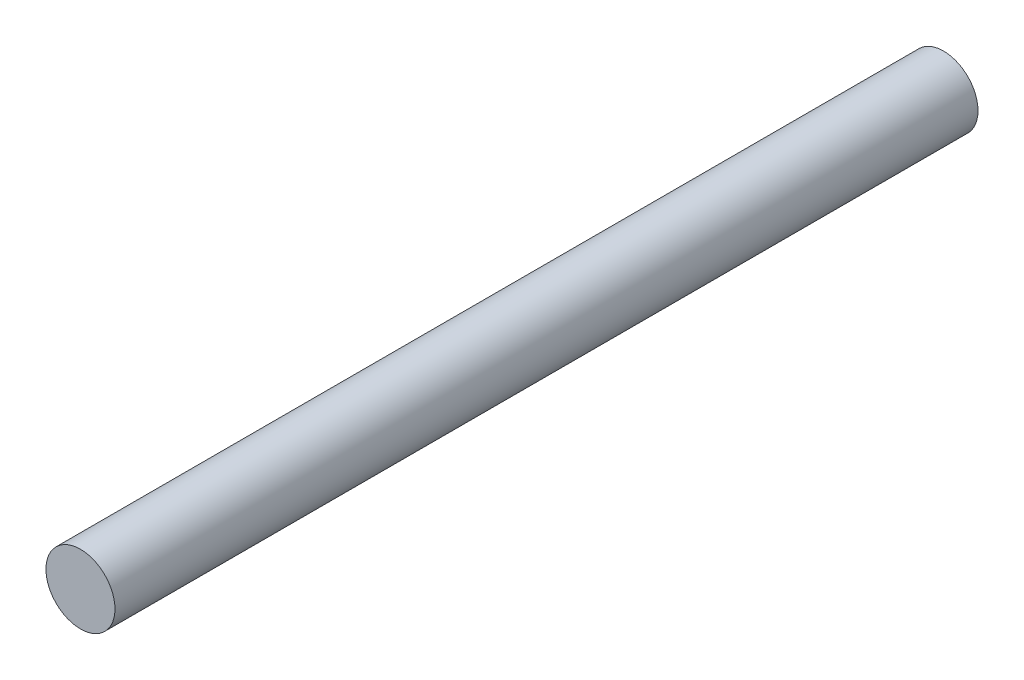
ISO-10303-21;
HEADER;
FILE_DESCRIPTION(('STEP AP214'),'2;1');
FILE_NAME('part.step','',(''),(''),'','','');
FILE_SCHEMA(('AUTOMOTIVE_DESIGN { 1 0 10303 214 1 1 1 1 }'));
ENDSEC;
DATA;
#1=APPLICATION_CONTEXT('core data for automotive mechanical design processes');
#2=APPLICATION_PROTOCOL_DEFINITION('international standard','automotive_design',2000,#1);
#3=PRODUCT_CONTEXT('',#1,'mechanical');
#4=PRODUCT('Part','Part','',(#3));
#5=PRODUCT_RELATED_PRODUCT_CATEGORY('part','',(#4));
#6=PRODUCT_DEFINITION_FORMATION('','',#4);
#7=PRODUCT_DEFINITION_CONTEXT('part definition',#1,'design');
#8=PRODUCT_DEFINITION('design','',#6,#7);
#9=PRODUCT_DEFINITION_SHAPE('','',#8);
#10=(LENGTH_UNIT() NAMED_UNIT(*) SI_UNIT(.MILLI.,.METRE.));
#11=(NAMED_UNIT(*) PLANE_ANGLE_UNIT() SI_UNIT($,.RADIAN.));
#12=(NAMED_UNIT(*) SI_UNIT($,.STERADIAN.) SOLID_ANGLE_UNIT());
#13=UNCERTAINTY_MEASURE_WITH_UNIT(LENGTH_MEASURE(1.E-05),#10,'distance_accuracy_value','');
#14=(GEOMETRIC_REPRESENTATION_CONTEXT(3) GLOBAL_UNCERTAINTY_ASSIGNED_CONTEXT((#13)) GLOBAL_UNIT_ASSIGNED_CONTEXT((#10,
#11,#12)) REPRESENTATION_CONTEXT('',''));
#15=CARTESIAN_POINT('',(0.,0.,0.));
#16=DIRECTION('',(0.,0.,1.));
#17=DIRECTION('',(1.,0.,0.));
#18=AXIS2_PLACEMENT_3D('',#15,#16,#17);
#19=CARTESIAN_POINT('',(0.,0.,15.875));
#20=DIRECTION('',(0.,0.,-1.));
#21=DIRECTION('',(-1.,0.,0.));
#22=AXIS2_PLACEMENT_3D('',#19,#20,#21);
#23=CYLINDRICAL_SURFACE('',#22,1.27);
#24=CARTESIAN_POINT('',(0.,0.,15.875));
#25=DIRECTION('',(0.,0.,1.));
#26=DIRECTION('',(1.,0.,0.));
#27=AXIS2_PLACEMENT_3D('',#24,#25,#26);
#28=CIRCLE('',#27,1.27);
#29=CARTESIAN_POINT('',(1.27,0.,15.875));
#30=VERTEX_POINT('',#29);
#31=EDGE_CURVE('E10',#30,#30,#28,.T.);
#32=ORIENTED_EDGE('',*,*,#31,.F.);
#33=EDGE_LOOP('',(#32));
#34=FACE_BOUND('',#33,.T.);
#35=CARTESIAN_POINT('',(0.,0.,-15.875));
#36=DIRECTION('',(0.,0.,1.));
#37=DIRECTION('',(1.,0.,0.));
#38=AXIS2_PLACEMENT_3D('',#35,#36,#37);
#39=CIRCLE('',#38,1.27);
#40=CARTESIAN_POINT('',(1.27,0.,-15.875));
#41=VERTEX_POINT('',#40);
#42=EDGE_CURVE('E34',#41,#41,#39,.T.);
#43=ORIENTED_EDGE('',*,*,#42,.T.);
#44=EDGE_LOOP('',(#43));
#45=FACE_BOUND('',#44,.T.);
#46=ADVANCED_FACE('F31',(#34,#45),#23,.T.);
#47=CARTESIAN_POINT('',(0.,0.,15.875));
#48=DIRECTION('',(0.,0.,1.));
#49=DIRECTION('',(1.,0.,0.));
#50=AXIS2_PLACEMENT_3D('',#47,#48,#49);
#51=PLANE('',#50);
#52=ORIENTED_EDGE('',*,*,#31,.T.);
#53=EDGE_LOOP('',(#52));
#54=FACE_BOUND('',#53,.T.);
#55=ADVANCED_FACE('F46',(#54),#51,.T.);
#56=CARTESIAN_POINT('',(0.,0.,-15.875));
#57=DIRECTION('',(0.,0.,1.));
#58=DIRECTION('',(1.,0.,0.));
#59=AXIS2_PLACEMENT_3D('',#56,#57,#58);
#60=PLANE('',#59);
#61=ORIENTED_EDGE('',*,*,#42,.F.);
#62=EDGE_LOOP('',(#61));
#63=FACE_BOUND('',#62,.T.);
#64=ADVANCED_FACE('F44',(#63),#60,.F.);
#65=CLOSED_SHELL('',(#46,#55,#64));
#66=MANIFOLD_SOLID_BREP('B2',#65);
#67=ADVANCED_BREP_SHAPE_REPRESENTATION('',(#18,#66),#14);
#68=SHAPE_DEFINITION_REPRESENTATION(#9,#67);
ENDSEC;
END-ISO-10303-21;
